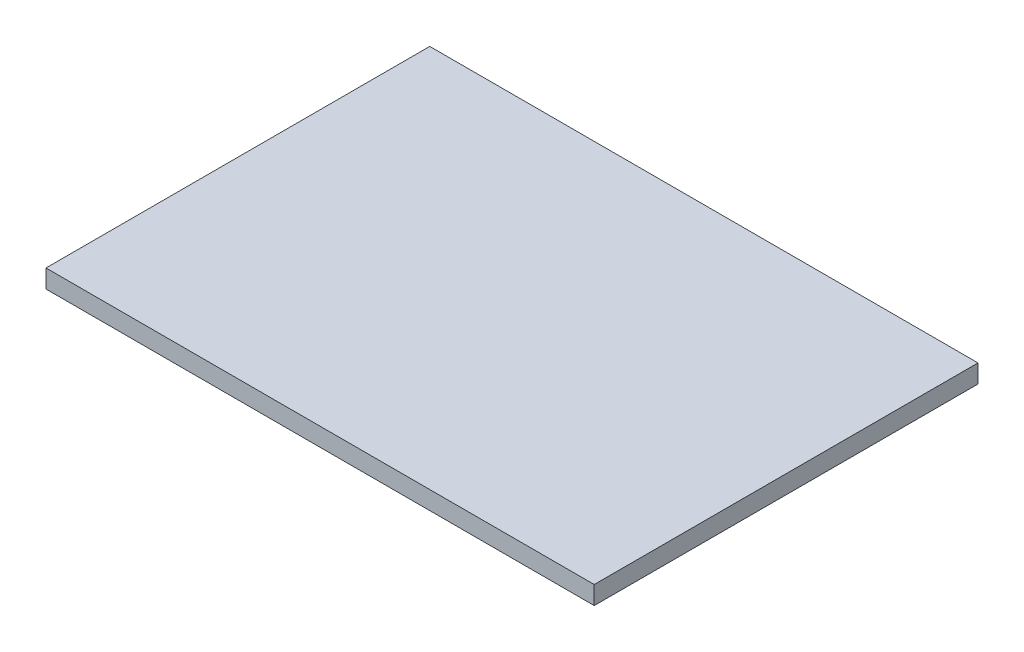
ISO-10303-21;
HEADER;
FILE_DESCRIPTION(('STEP AP214'),'2;1');
FILE_NAME('part.step','',(''),(''),'','','');
FILE_SCHEMA(('AUTOMOTIVE_DESIGN { 1 0 10303 214 1 1 1 1 }'));
ENDSEC;
DATA;
#1=APPLICATION_CONTEXT('core data for automotive mechanical design processes');
#2=APPLICATION_PROTOCOL_DEFINITION('international standard','automotive_design',2000,#1);
#3=PRODUCT_CONTEXT('',#1,'mechanical');
#4=PRODUCT('Part','Part','',(#3));
#5=PRODUCT_RELATED_PRODUCT_CATEGORY('part','',(#4));
#6=PRODUCT_DEFINITION_FORMATION('','',#4);
#7=PRODUCT_DEFINITION_CONTEXT('part definition',#1,'design');
#8=PRODUCT_DEFINITION('design','',#6,#7);
#9=PRODUCT_DEFINITION_SHAPE('','',#8);
#10=(LENGTH_UNIT() NAMED_UNIT(*) SI_UNIT(.MILLI.,.METRE.));
#11=(NAMED_UNIT(*) PLANE_ANGLE_UNIT() SI_UNIT($,.RADIAN.));
#12=(NAMED_UNIT(*) SI_UNIT($,.STERADIAN.) SOLID_ANGLE_UNIT());
#13=UNCERTAINTY_MEASURE_WITH_UNIT(LENGTH_MEASURE(1.E-05),#10,'distance_accuracy_value','');
#14=(GEOMETRIC_REPRESENTATION_CONTEXT(3) GLOBAL_UNCERTAINTY_ASSIGNED_CONTEXT((#13)) GLOBAL_UNIT_ASSIGNED_CONTEXT((#10,
#11,#12)) REPRESENTATION_CONTEXT('',''));
#15=CARTESIAN_POINT('',(0.,0.,0.));
#16=DIRECTION('',(0.,0.,1.));
#17=DIRECTION('',(1.,0.,0.));
#18=AXIS2_PLACEMENT_3D('',#15,#16,#17);
#19=CARTESIAN_POINT('',(-13.3,1.,-12.6));
#20=DIRECTION('',(1.,0.,0.));
#21=DIRECTION('',(0.,0.,-1.));
#22=AXIS2_PLACEMENT_3D('',#19,#20,#21);
#23=PLANE('',#22);
#24=DIRECTION('',(0.,0.,1.));
#25=VECTOR('',#24,1.);
#26=CARTESIAN_POINT('',(-13.3,0.,-12.6));
#27=LINE('',#26,#25);
#28=CARTESIAN_POINT('',(-13.3,0.,-12.6));
#29=VERTEX_POINT('',#28);
#30=CARTESIAN_POINT('',(-13.3,0.,8.4));
#31=VERTEX_POINT('',#30);
#32=EDGE_CURVE('E97',#29,#31,#27,.T.);
#33=ORIENTED_EDGE('',*,*,#32,.T.);
#34=DIRECTION('',(0.,-1.,0.));
#35=VECTOR('',#34,1.);
#36=CARTESIAN_POINT('',(-13.3,1.,8.4));
#37=LINE('',#36,#35);
#38=CARTESIAN_POINT('',(-13.3,1.,8.4));
#39=VERTEX_POINT('',#38);
#40=EDGE_CURVE('E11',#39,#31,#37,.T.);
#41=ORIENTED_EDGE('',*,*,#40,.F.);
#42=DIRECTION('',(0.,0.,1.));
#43=VECTOR('',#42,1.);
#44=CARTESIAN_POINT('',(-13.3,1.,-12.6));
#45=LINE('',#44,#43);
#46=CARTESIAN_POINT('',(-13.3,1.,-12.6));
#47=VERTEX_POINT('',#46);
#48=EDGE_CURVE('E85',#47,#39,#45,.T.);
#49=ORIENTED_EDGE('',*,*,#48,.F.);
#50=DIRECTION('',(0.,-1.,0.));
#51=VECTOR('',#50,1.);
#52=CARTESIAN_POINT('',(-13.3,1.,-12.6));
#53=LINE('',#52,#51);
#54=EDGE_CURVE('E93',#47,#29,#53,.T.);
#55=ORIENTED_EDGE('',*,*,#54,.T.);
#56=EDGE_LOOP('',(#33,#41,#49,#55));
#57=FACE_BOUND('',#56,.T.);
#58=ADVANCED_FACE('F34',(#57),#23,.F.);
#59=CARTESIAN_POINT('',(-13.3,1.,8.4));
#60=DIRECTION('',(0.,0.,-1.));
#61=DIRECTION('',(-1.,0.,0.));
#62=AXIS2_PLACEMENT_3D('',#59,#60,#61);
#63=PLANE('',#62);
#64=DIRECTION('',(1.,0.,0.));
#65=VECTOR('',#64,1.);
#66=CARTESIAN_POINT('',(-13.3,0.,8.4));
#67=LINE('',#66,#65);
#68=CARTESIAN_POINT('',(16.7,0.,8.4));
#69=VERTEX_POINT('',#68);
#70=EDGE_CURVE('E89',#31,#69,#67,.T.);
#71=ORIENTED_EDGE('',*,*,#70,.T.);
#72=DIRECTION('',(0.,-1.,0.));
#73=VECTOR('',#72,1.);
#74=CARTESIAN_POINT('',(16.7,1.,8.4));
#75=LINE('',#74,#73);
#76=CARTESIAN_POINT('',(16.7,1.,8.4));
#77=VERTEX_POINT('',#76);
#78=EDGE_CURVE('E42',#77,#69,#75,.T.);
#79=ORIENTED_EDGE('',*,*,#78,.F.);
#80=DIRECTION('',(1.,0.,0.));
#81=VECTOR('',#80,1.);
#82=CARTESIAN_POINT('',(-13.3,1.,8.4));
#83=LINE('',#82,#81);
#84=EDGE_CURVE('E80',#39,#77,#83,.T.);
#85=ORIENTED_EDGE('',*,*,#84,.F.);
#86=ORIENTED_EDGE('',*,*,#40,.T.);
#87=EDGE_LOOP('',(#71,#79,#85,#86));
#88=FACE_BOUND('',#87,.T.);
#89=ADVANCED_FACE('F88',(#88),#63,.F.);
#90=CARTESIAN_POINT('',(16.7,1.,-12.6));
#91=DIRECTION('',(-1.,0.,0.));
#92=DIRECTION('',(0.,0.,1.));
#93=AXIS2_PLACEMENT_3D('',#90,#91,#92);
#94=PLANE('',#93);
#95=DIRECTION('',(0.,0.,-1.));
#96=VECTOR('',#95,1.);
#97=CARTESIAN_POINT('',(16.7,0.,-12.6));
#98=LINE('',#97,#96);
#99=CARTESIAN_POINT('',(16.7,0.,-12.6));
#100=VERTEX_POINT('',#99);
#101=EDGE_CURVE('E67',#69,#100,#98,.T.);
#102=ORIENTED_EDGE('',*,*,#101,.T.);
#103=DIRECTION('',(0.,-1.,0.));
#104=VECTOR('',#103,1.);
#105=CARTESIAN_POINT('',(16.7,1.,-12.6));
#106=LINE('',#105,#104);
#107=CARTESIAN_POINT('',(16.7,1.,-12.6));
#108=VERTEX_POINT('',#107);
#109=EDGE_CURVE('E90',#108,#100,#106,.T.);
#110=ORIENTED_EDGE('',*,*,#109,.F.);
#111=DIRECTION('',(0.,0.,-1.));
#112=VECTOR('',#111,1.);
#113=CARTESIAN_POINT('',(16.7,1.,-12.6));
#114=LINE('',#113,#112);
#115=EDGE_CURVE('E83',#77,#108,#114,.T.);
#116=ORIENTED_EDGE('',*,*,#115,.F.);
#117=ORIENTED_EDGE('',*,*,#78,.T.);
#118=EDGE_LOOP('',(#102,#110,#116,#117));
#119=FACE_BOUND('',#118,.T.);
#120=ADVANCED_FACE('F91',(#119),#94,.F.);
#121=CARTESIAN_POINT('',(-13.3,1.,-12.6));
#122=DIRECTION('',(0.,0.,1.));
#123=DIRECTION('',(1.,0.,0.));
#124=AXIS2_PLACEMENT_3D('',#121,#122,#123);
#125=PLANE('',#124);
#126=DIRECTION('',(-1.,0.,0.));
#127=VECTOR('',#126,1.);
#128=CARTESIAN_POINT('',(-13.3,0.,-12.6));
#129=LINE('',#128,#127);
#130=EDGE_CURVE('E73',#100,#29,#129,.T.);
#131=ORIENTED_EDGE('',*,*,#130,.T.);
#132=ORIENTED_EDGE('',*,*,#54,.F.);
#133=DIRECTION('',(-1.,0.,0.));
#134=VECTOR('',#133,1.);
#135=CARTESIAN_POINT('',(-13.3,1.,-12.6));
#136=LINE('',#135,#134);
#137=EDGE_CURVE('E50',#108,#47,#136,.T.);
#138=ORIENTED_EDGE('',*,*,#137,.F.);
#139=ORIENTED_EDGE('',*,*,#109,.T.);
#140=EDGE_LOOP('',(#131,#132,#138,#139));
#141=FACE_BOUND('',#140,.T.);
#142=ADVANCED_FACE('F104',(#141),#125,.F.);
#143=CARTESIAN_POINT('',(0.,1.,0.));
#144=DIRECTION('',(0.,1.,0.));
#145=DIRECTION('',(0.,0.,1.));
#146=AXIS2_PLACEMENT_3D('',#143,#144,#145);
#147=PLANE('',#146);
#148=ORIENTED_EDGE('',*,*,#48,.T.);
#149=ORIENTED_EDGE('',*,*,#84,.T.);
#150=ORIENTED_EDGE('',*,*,#115,.T.);
#151=ORIENTED_EDGE('',*,*,#137,.T.);
#152=EDGE_LOOP('',(#148,#149,#150,#151));
#153=FACE_BOUND('',#152,.T.);
#154=ADVANCED_FACE('F81',(#153),#147,.T.);
#155=CARTESIAN_POINT('',(0.,0.,0.));
#156=DIRECTION('',(0.,1.,0.));
#157=DIRECTION('',(0.,0.,1.));
#158=AXIS2_PLACEMENT_3D('',#155,#156,#157);
#159=PLANE('',#158);
#160=ORIENTED_EDGE('',*,*,#32,.F.);
#161=ORIENTED_EDGE('',*,*,#130,.F.);
#162=ORIENTED_EDGE('',*,*,#101,.F.);
#163=ORIENTED_EDGE('',*,*,#70,.F.);
#164=EDGE_LOOP('',(#160,#161,#162,#163));
#165=FACE_BOUND('',#164,.T.);
#166=ADVANCED_FACE('F107',(#165),#159,.F.);
#167=CLOSED_SHELL('',(#58,#89,#120,#142,#154,#166));
#168=MANIFOLD_SOLID_BREP('B2',#167);
#169=ADVANCED_BREP_SHAPE_REPRESENTATION('',(#18,#168),#14);
#170=SHAPE_DEFINITION_REPRESENTATION(#9,#169);
ENDSEC;
END-ISO-10303-21;
